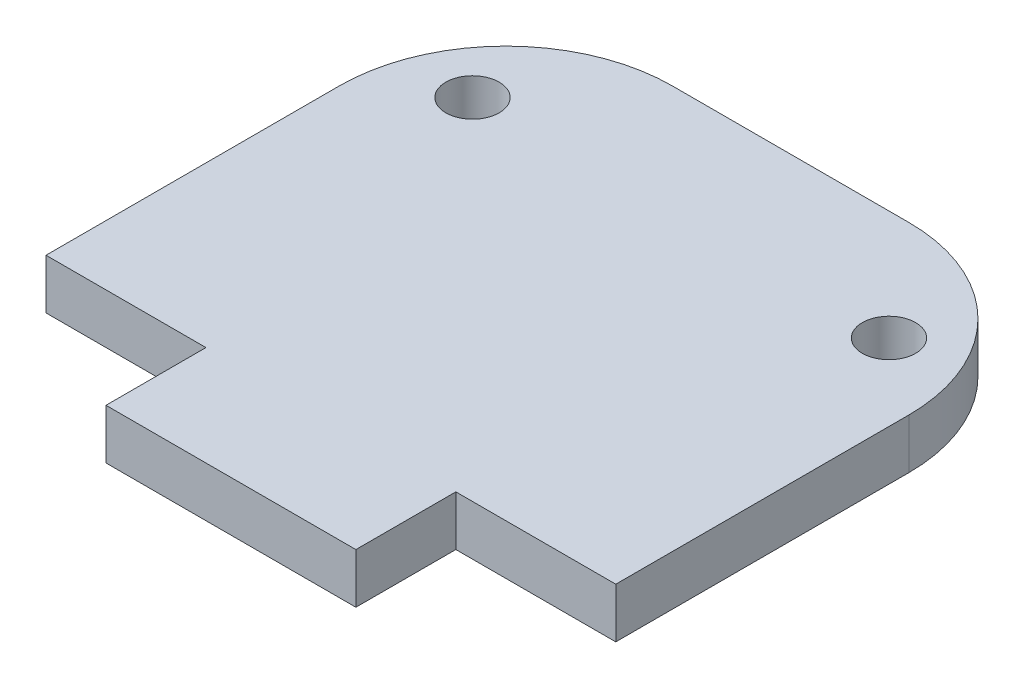
ISO-10303-21;
HEADER;
FILE_DESCRIPTION(('STEP AP214'),'2;1');
FILE_NAME('part.step','',(''),(''),'','','');
FILE_SCHEMA(('AUTOMOTIVE_DESIGN { 1 0 10303 214 1 1 1 1 }'));
ENDSEC;
DATA;
#1=APPLICATION_CONTEXT('core data for automotive mechanical design processes');
#2=APPLICATION_PROTOCOL_DEFINITION('international standard','automotive_design',2000,#1);
#3=PRODUCT_CONTEXT('',#1,'mechanical');
#4=PRODUCT('Part','Part','',(#3));
#5=PRODUCT_RELATED_PRODUCT_CATEGORY('part','',(#4));
#6=PRODUCT_DEFINITION_FORMATION('','',#4);
#7=PRODUCT_DEFINITION_CONTEXT('part definition',#1,'design');
#8=PRODUCT_DEFINITION('design','',#6,#7);
#9=PRODUCT_DEFINITION_SHAPE('','',#8);
#10=(LENGTH_UNIT() NAMED_UNIT(*) SI_UNIT(.MILLI.,.METRE.));
#11=(NAMED_UNIT(*) PLANE_ANGLE_UNIT() SI_UNIT($,.RADIAN.));
#12=(NAMED_UNIT(*) SI_UNIT($,.STERADIAN.) SOLID_ANGLE_UNIT());
#13=UNCERTAINTY_MEASURE_WITH_UNIT(LENGTH_MEASURE(1.E-05),#10,'distance_accuracy_value','');
#14=(GEOMETRIC_REPRESENTATION_CONTEXT(3) GLOBAL_UNCERTAINTY_ASSIGNED_CONTEXT((#13)) GLOBAL_UNIT_ASSIGNED_CONTEXT((#10,
#11,#12)) REPRESENTATION_CONTEXT('',''));
#15=CARTESIAN_POINT('',(0.,0.,0.));
#16=DIRECTION('',(0.,0.,1.));
#17=DIRECTION('',(1.,0.,0.));
#18=AXIS2_PLACEMENT_3D('',#15,#16,#17);
#19=CARTESIAN_POINT('',(-7.1,0.,-23.6));
#20=DIRECTION('',(0.,-1.,0.));
#21=DIRECTION('',(0.,0.,-1.));
#22=AXIS2_PLACEMENT_3D('',#19,#20,#21);
#23=CYLINDRICAL_SURFACE('',#22,10.);
#24=CARTESIAN_POINT('',(-7.1,-3.,-23.6));
#25=DIRECTION('',(0.,-1.,0.));
#26=DIRECTION('',(0.,0.,-1.));
#27=AXIS2_PLACEMENT_3D('',#24,#25,#26);
#28=CIRCLE('',#27,10.);
#29=CARTESIAN_POINT('',(-17.1,-3.,-23.6));
#30=VERTEX_POINT('',#29);
#31=CARTESIAN_POINT('',(-7.1,-3.,-33.6));
#32=VERTEX_POINT('',#31);
#33=EDGE_CURVE('E141',#30,#32,#28,.T.);
#34=ORIENTED_EDGE('',*,*,#33,.F.);
#35=DIRECTION('',(0.,-1.,0.));
#36=VECTOR('',#35,1.);
#37=CARTESIAN_POINT('',(-17.1,0.,-23.6));
#38=LINE('',#37,#36);
#39=CARTESIAN_POINT('',(-17.1,0.,-23.6));
#40=VERTEX_POINT('',#39);
#41=EDGE_CURVE('E11',#40,#30,#38,.T.);
#42=ORIENTED_EDGE('',*,*,#41,.F.);
#43=CARTESIAN_POINT('',(-7.1,0.,-23.6));
#44=DIRECTION('',(0.,-1.,0.));
#45=DIRECTION('',(0.,0.,-1.));
#46=AXIS2_PLACEMENT_3D('',#43,#44,#45);
#47=CIRCLE('',#46,10.);
#48=CARTESIAN_POINT('',(-7.1,0.,-33.6));
#49=VERTEX_POINT('',#48);
#50=EDGE_CURVE('E168',#40,#49,#47,.T.);
#51=ORIENTED_EDGE('',*,*,#50,.T.);
#52=DIRECTION('',(0.,-1.,0.));
#53=VECTOR('',#52,1.);
#54=CARTESIAN_POINT('',(-7.1,0.,-33.6));
#55=LINE('',#54,#53);
#56=EDGE_CURVE('E35',#49,#32,#55,.T.);
#57=ORIENTED_EDGE('',*,*,#56,.T.);
#58=EDGE_LOOP('',(#34,#42,#51,#57));
#59=FACE_BOUND('',#58,.T.);
#60=ADVANCED_FACE('F32',(#59),#23,.T.);
#61=CARTESIAN_POINT('',(-17.1,0.,-6.00000000000001));
#62=DIRECTION('',(-1.,0.,0.));
#63=DIRECTION('',(0.,0.,1.));
#64=AXIS2_PLACEMENT_3D('',#61,#62,#63);
#65=PLANE('',#64);
#66=DIRECTION('',(0.,0.,-1.));
#67=VECTOR('',#66,1.);
#68=CARTESIAN_POINT('',(-17.1,-3.,-6.00000000000001));
#69=LINE('',#68,#67);
#70=CARTESIAN_POINT('',(-17.1,-3.,-6.00000000000001));
#71=VERTEX_POINT('',#70);
#72=EDGE_CURVE('E166',#71,#30,#69,.T.);
#73=ORIENTED_EDGE('',*,*,#72,.F.);
#74=DIRECTION('',(0.,-1.,0.));
#75=VECTOR('',#74,1.);
#76=CARTESIAN_POINT('',(-17.1,0.,-6.00000000000001));
#77=LINE('',#76,#75);
#78=CARTESIAN_POINT('',(-17.1,0.,-6.00000000000001));
#79=VERTEX_POINT('',#78);
#80=EDGE_CURVE('E41',#79,#71,#77,.T.);
#81=ORIENTED_EDGE('',*,*,#80,.F.);
#82=DIRECTION('',(0.,0.,-1.));
#83=VECTOR('',#82,1.);
#84=CARTESIAN_POINT('',(-17.1,0.,-6.00000000000001));
#85=LINE('',#84,#83);
#86=EDGE_CURVE('E131',#79,#40,#85,.T.);
#87=ORIENTED_EDGE('',*,*,#86,.T.);
#88=ORIENTED_EDGE('',*,*,#41,.T.);
#89=EDGE_LOOP('',(#73,#81,#87,#88));
#90=FACE_BOUND('',#89,.T.);
#91=ADVANCED_FACE('F184',(#90),#65,.T.);
#92=CARTESIAN_POINT('',(-7.5,0.,-6.00000000000001));
#93=DIRECTION('',(0.,0.,1.));
#94=DIRECTION('',(1.,0.,0.));
#95=AXIS2_PLACEMENT_3D('',#92,#93,#94);
#96=PLANE('',#95);
#97=DIRECTION('',(-1.,0.,0.));
#98=VECTOR('',#97,1.);
#99=CARTESIAN_POINT('',(-7.5,-3.,-6.00000000000001));
#100=LINE('',#99,#98);
#101=CARTESIAN_POINT('',(-7.5,-3.,-6.00000000000001));
#102=VERTEX_POINT('',#101);
#103=EDGE_CURVE('E118',#102,#71,#100,.T.);
#104=ORIENTED_EDGE('',*,*,#103,.F.);
#105=DIRECTION('',(0.,-1.,0.));
#106=VECTOR('',#105,1.);
#107=CARTESIAN_POINT('',(-7.5,0.,-6.00000000000001));
#108=LINE('',#107,#106);
#109=CARTESIAN_POINT('',(-7.5,0.,-6.00000000000001));
#110=VERTEX_POINT('',#109);
#111=EDGE_CURVE('E113',#110,#102,#108,.T.);
#112=ORIENTED_EDGE('',*,*,#111,.F.);
#113=DIRECTION('',(-1.,0.,0.));
#114=VECTOR('',#113,1.);
#115=CARTESIAN_POINT('',(-7.5,0.,-6.00000000000001));
#116=LINE('',#115,#114);
#117=EDGE_CURVE('E116',#110,#79,#116,.T.);
#118=ORIENTED_EDGE('',*,*,#117,.T.);
#119=ORIENTED_EDGE('',*,*,#80,.T.);
#120=EDGE_LOOP('',(#104,#112,#118,#119));
#121=FACE_BOUND('',#120,.T.);
#122=ADVANCED_FACE('F115',(#121),#96,.T.);
#123=CARTESIAN_POINT('',(-7.5,0.,0.));
#124=DIRECTION('',(-1.,0.,0.));
#125=DIRECTION('',(0.,0.,1.));
#126=AXIS2_PLACEMENT_3D('',#123,#124,#125);
#127=PLANE('',#126);
#128=DIRECTION('',(0.,0.,-1.));
#129=VECTOR('',#128,1.);
#130=CARTESIAN_POINT('',(-7.5,-3.,0.));
#131=LINE('',#130,#129);
#132=CARTESIAN_POINT('',(-7.5,-3.,0.));
#133=VERTEX_POINT('',#132);
#134=EDGE_CURVE('E163',#133,#102,#131,.T.);
#135=ORIENTED_EDGE('',*,*,#134,.F.);
#136=DIRECTION('',(0.,-1.,0.));
#137=VECTOR('',#136,1.);
#138=CARTESIAN_POINT('',(-7.5,0.,0.));
#139=LINE('',#138,#137);
#140=CARTESIAN_POINT('',(-7.5,0.,0.));
#141=VERTEX_POINT('',#140);
#142=EDGE_CURVE('E123',#141,#133,#139,.T.);
#143=ORIENTED_EDGE('',*,*,#142,.F.);
#144=DIRECTION('',(0.,0.,-1.));
#145=VECTOR('',#144,1.);
#146=CARTESIAN_POINT('',(-7.5,0.,0.));
#147=LINE('',#146,#145);
#148=EDGE_CURVE('E129',#141,#110,#147,.T.);
#149=ORIENTED_EDGE('',*,*,#148,.T.);
#150=ORIENTED_EDGE('',*,*,#111,.T.);
#151=EDGE_LOOP('',(#135,#143,#149,#150));
#152=FACE_BOUND('',#151,.T.);
#153=ADVANCED_FACE('F133',(#152),#127,.T.);
#154=CARTESIAN_POINT('',(7.5,0.,0.));
#155=DIRECTION('',(0.,0.,1.));
#156=DIRECTION('',(1.,0.,0.));
#157=AXIS2_PLACEMENT_3D('',#154,#155,#156);
#158=PLANE('',#157);
#159=DIRECTION('',(-1.,0.,0.));
#160=VECTOR('',#159,1.);
#161=CARTESIAN_POINT('',(7.5,-3.,0.));
#162=LINE('',#161,#160);
#163=CARTESIAN_POINT('',(7.5,-3.,0.));
#164=VERTEX_POINT('',#163);
#165=EDGE_CURVE('E160',#164,#133,#162,.T.);
#166=ORIENTED_EDGE('',*,*,#165,.F.);
#167=DIRECTION('',(0.,-1.,0.));
#168=VECTOR('',#167,1.);
#169=CARTESIAN_POINT('',(7.5,0.,0.));
#170=LINE('',#169,#168);
#171=CARTESIAN_POINT('',(7.5,0.,0.));
#172=VERTEX_POINT('',#171);
#173=EDGE_CURVE('E172',#172,#164,#170,.T.);
#174=ORIENTED_EDGE('',*,*,#173,.F.);
#175=DIRECTION('',(-1.,0.,0.));
#176=VECTOR('',#175,1.);
#177=CARTESIAN_POINT('',(7.5,0.,0.));
#178=LINE('',#177,#176);
#179=EDGE_CURVE('E134',#172,#141,#178,.T.);
#180=ORIENTED_EDGE('',*,*,#179,.T.);
#181=ORIENTED_EDGE('',*,*,#142,.T.);
#182=EDGE_LOOP('',(#166,#174,#180,#181));
#183=FACE_BOUND('',#182,.T.);
#184=ADVANCED_FACE('F197',(#183),#158,.T.);
#185=CARTESIAN_POINT('',(7.5,0.,-6.00000000000001));
#186=DIRECTION('',(1.,0.,0.));
#187=DIRECTION('',(0.,0.,-1.));
#188=AXIS2_PLACEMENT_3D('',#185,#186,#187);
#189=PLANE('',#188);
#190=DIRECTION('',(0.,0.,1.));
#191=VECTOR('',#190,1.);
#192=CARTESIAN_POINT('',(7.5,-3.,-6.00000000000001));
#193=LINE('',#192,#191);
#194=CARTESIAN_POINT('',(7.5,-3.,-6.00000000000001));
#195=VERTEX_POINT('',#194);
#196=EDGE_CURVE('E157',#195,#164,#193,.T.);
#197=ORIENTED_EDGE('',*,*,#196,.F.);
#198=DIRECTION('',(0.,-1.,0.));
#199=VECTOR('',#198,1.);
#200=CARTESIAN_POINT('',(7.5,0.,-6.00000000000001));
#201=LINE('',#200,#199);
#202=CARTESIAN_POINT('',(7.5,0.,-6.00000000000001));
#203=VERTEX_POINT('',#202);
#204=EDGE_CURVE('E174',#203,#195,#201,.T.);
#205=ORIENTED_EDGE('',*,*,#204,.F.);
#206=DIRECTION('',(0.,0.,1.));
#207=VECTOR('',#206,1.);
#208=CARTESIAN_POINT('',(7.5,0.,-6.00000000000001));
#209=LINE('',#208,#207);
#210=EDGE_CURVE('E136',#203,#172,#209,.T.);
#211=ORIENTED_EDGE('',*,*,#210,.T.);
#212=ORIENTED_EDGE('',*,*,#173,.T.);
#213=EDGE_LOOP('',(#197,#205,#211,#212));
#214=FACE_BOUND('',#213,.T.);
#215=ADVANCED_FACE('F200',(#214),#189,.T.);
#216=CARTESIAN_POINT('',(17.1,0.,-6.00000000000001));
#217=DIRECTION('',(0.,0.,1.));
#218=DIRECTION('',(1.,0.,0.));
#219=AXIS2_PLACEMENT_3D('',#216,#217,#218);
#220=PLANE('',#219);
#221=DIRECTION('',(-1.,0.,0.));
#222=VECTOR('',#221,1.);
#223=CARTESIAN_POINT('',(17.1,-3.,-6.00000000000001));
#224=LINE('',#223,#222);
#225=CARTESIAN_POINT('',(17.1,-3.,-6.00000000000001));
#226=VERTEX_POINT('',#225);
#227=EDGE_CURVE('E154',#226,#195,#224,.T.);
#228=ORIENTED_EDGE('',*,*,#227,.F.);
#229=DIRECTION('',(0.,-1.,0.));
#230=VECTOR('',#229,1.);
#231=CARTESIAN_POINT('',(17.1,0.,-6.00000000000001));
#232=LINE('',#231,#230);
#233=CARTESIAN_POINT('',(17.1,0.,-6.00000000000001));
#234=VERTEX_POINT('',#233);
#235=EDGE_CURVE('E176',#234,#226,#232,.T.);
#236=ORIENTED_EDGE('',*,*,#235,.F.);
#237=DIRECTION('',(-1.,0.,0.));
#238=VECTOR('',#237,1.);
#239=CARTESIAN_POINT('',(17.1,0.,-6.00000000000001));
#240=LINE('',#239,#238);
#241=EDGE_CURVE('E260',#234,#203,#240,.T.);
#242=ORIENTED_EDGE('',*,*,#241,.T.);
#243=ORIENTED_EDGE('',*,*,#204,.T.);
#244=EDGE_LOOP('',(#228,#236,#242,#243));
#245=FACE_BOUND('',#244,.T.);
#246=ADVANCED_FACE('F204',(#245),#220,.T.);
#247=CARTESIAN_POINT('',(17.1,0.,-23.6));
#248=DIRECTION('',(1.,0.,0.));
#249=DIRECTION('',(0.,0.,-1.));
#250=AXIS2_PLACEMENT_3D('',#247,#248,#249);
#251=PLANE('',#250);
#252=DIRECTION('',(0.,0.,1.));
#253=VECTOR('',#252,1.);
#254=CARTESIAN_POINT('',(17.1,-3.,-23.6));
#255=LINE('',#254,#253);
#256=CARTESIAN_POINT('',(17.1,-3.,-23.6));
#257=VERTEX_POINT('',#256);
#258=EDGE_CURVE('E151',#257,#226,#255,.T.);
#259=ORIENTED_EDGE('',*,*,#258,.F.);
#260=DIRECTION('',(0.,-1.,0.));
#261=VECTOR('',#260,1.);
#262=CARTESIAN_POINT('',(17.1,0.,-23.6));
#263=LINE('',#262,#261);
#264=CARTESIAN_POINT('',(17.1,0.,-23.6));
#265=VERTEX_POINT('',#264);
#266=EDGE_CURVE('E178',#265,#257,#263,.T.);
#267=ORIENTED_EDGE('',*,*,#266,.F.);
#268=DIRECTION('',(0.,0.,1.));
#269=VECTOR('',#268,1.);
#270=CARTESIAN_POINT('',(17.1,0.,-23.6));
#271=LINE('',#270,#269);
#272=EDGE_CURVE('E257',#265,#234,#271,.T.);
#273=ORIENTED_EDGE('',*,*,#272,.T.);
#274=ORIENTED_EDGE('',*,*,#235,.T.);
#275=EDGE_LOOP('',(#259,#267,#273,#274));
#276=FACE_BOUND('',#275,.T.);
#277=ADVANCED_FACE('F208',(#276),#251,.T.);
#278=CARTESIAN_POINT('',(7.1,0.,-23.6));
#279=DIRECTION('',(0.,-1.,0.));
#280=DIRECTION('',(0.,0.,-1.));
#281=AXIS2_PLACEMENT_3D('',#278,#279,#280);
#282=CYLINDRICAL_SURFACE('',#281,10.);
#283=CARTESIAN_POINT('',(7.1,-3.,-23.6));
#284=DIRECTION('',(0.,-1.,0.));
#285=DIRECTION('',(0.,0.,-1.));
#286=AXIS2_PLACEMENT_3D('',#283,#284,#285);
#287=CIRCLE('',#286,10.);
#288=CARTESIAN_POINT('',(7.1,-3.,-33.6));
#289=VERTEX_POINT('',#288);
#290=EDGE_CURVE('E148',#289,#257,#287,.T.);
#291=ORIENTED_EDGE('',*,*,#290,.F.);
#292=DIRECTION('',(0.,-1.,0.));
#293=VECTOR('',#292,1.);
#294=CARTESIAN_POINT('',(7.1,0.,-33.6));
#295=LINE('',#294,#293);
#296=CARTESIAN_POINT('',(7.1,0.,-33.6));
#297=VERTEX_POINT('',#296);
#298=EDGE_CURVE('E179',#297,#289,#295,.T.);
#299=ORIENTED_EDGE('',*,*,#298,.F.);
#300=CARTESIAN_POINT('',(7.1,0.,-23.6));
#301=DIRECTION('',(0.,-1.,0.));
#302=DIRECTION('',(0.,0.,-1.));
#303=AXIS2_PLACEMENT_3D('',#300,#301,#302);
#304=CIRCLE('',#303,10.);
#305=EDGE_CURVE('E254',#297,#265,#304,.T.);
#306=ORIENTED_EDGE('',*,*,#305,.T.);
#307=ORIENTED_EDGE('',*,*,#266,.T.);
#308=EDGE_LOOP('',(#291,#299,#306,#307));
#309=FACE_BOUND('',#308,.T.);
#310=ADVANCED_FACE('F212',(#309),#282,.T.);
#311=CARTESIAN_POINT('',(-7.1,0.,-33.6));
#312=DIRECTION('',(0.,0.,-1.));
#313=DIRECTION('',(-1.,0.,0.));
#314=AXIS2_PLACEMENT_3D('',#311,#312,#313);
#315=PLANE('',#314);
#316=DIRECTION('',(1.,0.,0.));
#317=VECTOR('',#316,1.);
#318=CARTESIAN_POINT('',(-7.1,-3.,-33.6));
#319=LINE('',#318,#317);
#320=EDGE_CURVE('E144',#32,#289,#319,.T.);
#321=ORIENTED_EDGE('',*,*,#320,.F.);
#322=ORIENTED_EDGE('',*,*,#56,.F.);
#323=DIRECTION('',(1.,0.,0.));
#324=VECTOR('',#323,1.);
#325=CARTESIAN_POINT('',(-7.1,0.,-33.6));
#326=LINE('',#325,#324);
#327=EDGE_CURVE('E252',#49,#297,#326,.T.);
#328=ORIENTED_EDGE('',*,*,#327,.T.);
#329=ORIENTED_EDGE('',*,*,#298,.T.);
#330=EDGE_LOOP('',(#321,#322,#328,#329));
#331=FACE_BOUND('',#330,.T.);
#332=ADVANCED_FACE('F181',(#331),#315,.T.);
#333=CARTESIAN_POINT('',(-7.1,0.,-23.6));
#334=DIRECTION('',(0.,-1.,0.));
#335=DIRECTION('',(0.,0.,-1.));
#336=AXIS2_PLACEMENT_3D('',#333,#334,#335);
#337=PLANE('',#336);
#338=CARTESIAN_POINT('',(12.5,0.,-27.));
#339=DIRECTION('',(0.,-1.,0.));
#340=DIRECTION('',(0.,0.,1.));
#341=AXIS2_PLACEMENT_3D('',#338,#339,#340);
#342=CIRCLE('',#341,1.59999999999999);
#343=CARTESIAN_POINT('',(12.5,0.,-25.4));
#344=VERTEX_POINT('',#343);
#345=EDGE_CURVE('E239',#344,#344,#342,.T.);
#346=ORIENTED_EDGE('',*,*,#345,.T.);
#347=EDGE_LOOP('',(#346));
#348=FACE_BOUND('',#347,.T.);
#349=CARTESIAN_POINT('',(-12.5,0.,-27.));
#350=DIRECTION('',(0.,-1.,0.));
#351=DIRECTION('',(0.,0.,1.));
#352=AXIS2_PLACEMENT_3D('',#349,#350,#351);
#353=CIRCLE('',#352,1.59999999999999);
#354=CARTESIAN_POINT('',(-12.5,0.,-25.4));
#355=VERTEX_POINT('',#354);
#356=EDGE_CURVE('E145',#355,#355,#353,.T.);
#357=ORIENTED_EDGE('',*,*,#356,.T.);
#358=EDGE_LOOP('',(#357));
#359=FACE_BOUND('',#358,.T.);
#360=ORIENTED_EDGE('',*,*,#50,.F.);
#361=ORIENTED_EDGE('',*,*,#86,.F.);
#362=ORIENTED_EDGE('',*,*,#117,.F.);
#363=ORIENTED_EDGE('',*,*,#148,.F.);
#364=ORIENTED_EDGE('',*,*,#179,.F.);
#365=ORIENTED_EDGE('',*,*,#210,.F.);
#366=ORIENTED_EDGE('',*,*,#241,.F.);
#367=ORIENTED_EDGE('',*,*,#272,.F.);
#368=ORIENTED_EDGE('',*,*,#305,.F.);
#369=ORIENTED_EDGE('',*,*,#327,.F.);
#370=EDGE_LOOP('',(#360,#361,#362,#363,#364,#365,#366,#367,#368,#369));
#371=FACE_BOUND('',#370,.T.);
#372=ADVANCED_FACE('F127',(#348,#359,#371),#337,.F.);
#373=CARTESIAN_POINT('',(-7.1,-3.,-23.6));
#374=DIRECTION('',(0.,-1.,0.));
#375=DIRECTION('',(0.,0.,-1.));
#376=AXIS2_PLACEMENT_3D('',#373,#374,#375);
#377=PLANE('',#376);
#378=CARTESIAN_POINT('',(12.5,-3.,-27.));
#379=DIRECTION('',(0.,-1.,0.));
#380=DIRECTION('',(0.,0.,1.));
#381=AXIS2_PLACEMENT_3D('',#378,#379,#380);
#382=CIRCLE('',#381,1.59999999999999);
#383=CARTESIAN_POINT('',(12.5,-3.,-25.4));
#384=VERTEX_POINT('',#383);
#385=EDGE_CURVE('E242',#384,#384,#382,.T.);
#386=ORIENTED_EDGE('',*,*,#385,.F.);
#387=EDGE_LOOP('',(#386));
#388=FACE_BOUND('',#387,.T.);
#389=CARTESIAN_POINT('',(-12.5,-3.,-27.));
#390=DIRECTION('',(0.,-1.,0.));
#391=DIRECTION('',(0.,0.,1.));
#392=AXIS2_PLACEMENT_3D('',#389,#390,#391);
#393=CIRCLE('',#392,1.59999999999999);
#394=CARTESIAN_POINT('',(-12.5,-3.,-25.4));
#395=VERTEX_POINT('',#394);
#396=EDGE_CURVE('E244',#395,#395,#393,.T.);
#397=ORIENTED_EDGE('',*,*,#396,.F.);
#398=EDGE_LOOP('',(#397));
#399=FACE_BOUND('',#398,.T.);
#400=ORIENTED_EDGE('',*,*,#33,.T.);
#401=ORIENTED_EDGE('',*,*,#320,.T.);
#402=ORIENTED_EDGE('',*,*,#290,.T.);
#403=ORIENTED_EDGE('',*,*,#258,.T.);
#404=ORIENTED_EDGE('',*,*,#227,.T.);
#405=ORIENTED_EDGE('',*,*,#196,.T.);
#406=ORIENTED_EDGE('',*,*,#165,.T.);
#407=ORIENTED_EDGE('',*,*,#134,.T.);
#408=ORIENTED_EDGE('',*,*,#103,.T.);
#409=ORIENTED_EDGE('',*,*,#72,.T.);
#410=EDGE_LOOP('',(#400,#401,#402,#403,#404,#405,#406,#407,#408,#409));
#411=FACE_BOUND('',#410,.T.);
#412=ADVANCED_FACE('F183',(#388,#399,#411),#377,.T.);
#413=CARTESIAN_POINT('',(-12.5,0.,-27.));
#414=DIRECTION('',(0.,-1.,0.));
#415=DIRECTION('',(0.,0.,-1.));
#416=AXIS2_PLACEMENT_3D('',#413,#414,#415);
#417=CYLINDRICAL_SURFACE('',#416,1.59999999999999);
#418=ORIENTED_EDGE('',*,*,#356,.F.);
#419=EDGE_LOOP('',(#418));
#420=FACE_BOUND('',#419,.T.);
#421=ORIENTED_EDGE('',*,*,#396,.T.);
#422=EDGE_LOOP('',(#421));
#423=FACE_BOUND('',#422,.T.);
#424=ADVANCED_FACE('F224',(#420,#423),#417,.F.);
#425=CARTESIAN_POINT('',(12.5,0.,-27.));
#426=DIRECTION('',(0.,-1.,0.));
#427=DIRECTION('',(0.,0.,-1.));
#428=AXIS2_PLACEMENT_3D('',#425,#426,#427);
#429=CYLINDRICAL_SURFACE('',#428,1.59999999999999);
#430=ORIENTED_EDGE('',*,*,#345,.F.);
#431=EDGE_LOOP('',(#430));
#432=FACE_BOUND('',#431,.T.);
#433=ORIENTED_EDGE('',*,*,#385,.T.);
#434=EDGE_LOOP('',(#433));
#435=FACE_BOUND('',#434,.T.);
#436=ADVANCED_FACE('F231',(#432,#435),#429,.F.);
#437=CLOSED_SHELL('',(#60,#91,#122,#153,#184,#215,#246,#277,#310,#332,#372,#412,#424,#436));
#438=MANIFOLD_SOLID_BREP('B2',#437);
#439=ADVANCED_BREP_SHAPE_REPRESENTATION('',(#18,#438),#14);
#440=SHAPE_DEFINITION_REPRESENTATION(#9,#439);
ENDSEC;
END-ISO-10303-21;
